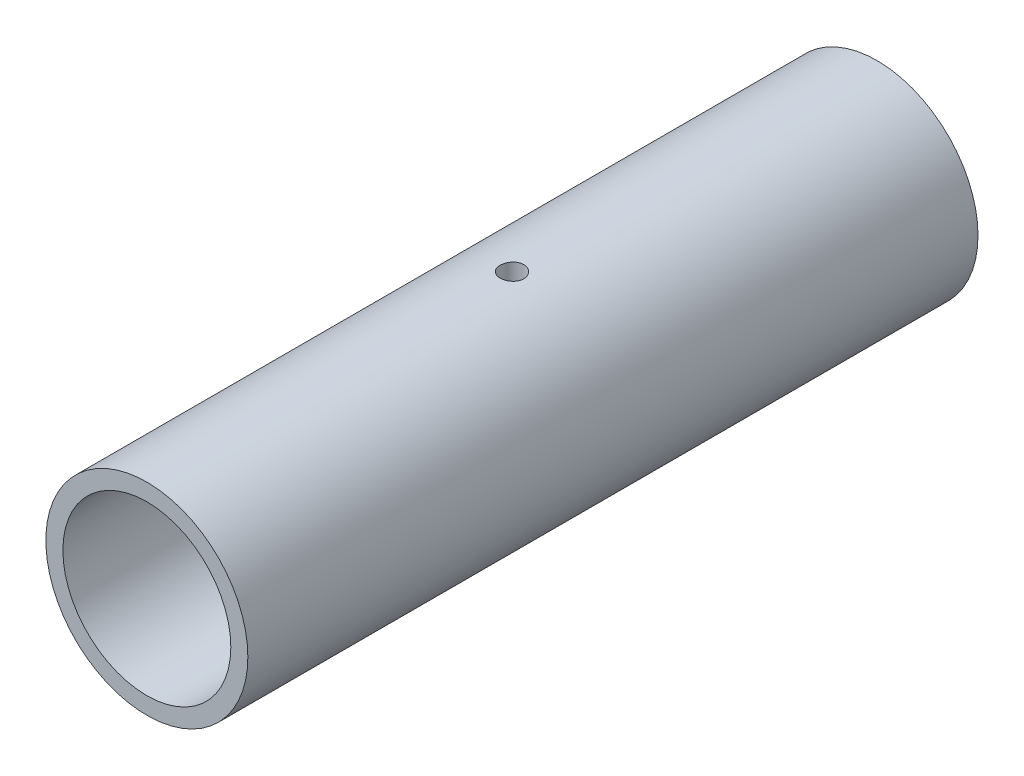
ISO-10303-21;
HEADER;
FILE_DESCRIPTION(('STEP AP214'),'2;1');
FILE_NAME('part.step','',(''),(''),'','','');
FILE_SCHEMA(('AUTOMOTIVE_DESIGN { 1 0 10303 214 1 1 1 1 }'));
ENDSEC;
DATA;
#1=APPLICATION_CONTEXT('core data for automotive mechanical design processes');
#2=APPLICATION_PROTOCOL_DEFINITION('international standard','automotive_design',2000,#1);
#3=PRODUCT_CONTEXT('',#1,'mechanical');
#4=PRODUCT('Part','Part','',(#3));
#5=PRODUCT_RELATED_PRODUCT_CATEGORY('part','',(#4));
#6=PRODUCT_DEFINITION_FORMATION('','',#4);
#7=PRODUCT_DEFINITION_CONTEXT('part definition',#1,'design');
#8=PRODUCT_DEFINITION('design','',#6,#7);
#9=PRODUCT_DEFINITION_SHAPE('','',#8);
#10=(LENGTH_UNIT() NAMED_UNIT(*) SI_UNIT(.MILLI.,.METRE.));
#11=(NAMED_UNIT(*) PLANE_ANGLE_UNIT() SI_UNIT($,.RADIAN.));
#12=(NAMED_UNIT(*) SI_UNIT($,.STERADIAN.) SOLID_ANGLE_UNIT());
#13=UNCERTAINTY_MEASURE_WITH_UNIT(LENGTH_MEASURE(1.E-05),#10,'distance_accuracy_value','');
#14=(GEOMETRIC_REPRESENTATION_CONTEXT(3) GLOBAL_UNCERTAINTY_ASSIGNED_CONTEXT((#13)) GLOBAL_UNIT_ASSIGNED_CONTEXT((#10,
#11,#12)) REPRESENTATION_CONTEXT('',''));
#15=CARTESIAN_POINT('',(0.,0.,0.));
#16=DIRECTION('',(0.,0.,1.));
#17=DIRECTION('',(1.,0.,0.));
#18=AXIS2_PLACEMENT_3D('',#15,#16,#17);
#19=CARTESIAN_POINT('',(-21.0819999999998,21.0819999999998,-152.4));
#20=DIRECTION('',(0.,0.,0.999999999999999));
#21=DIRECTION('',(0.999999999999999,0.,0.));
#22=AXIS2_PLACEMENT_3D('',#19,#20,#21);
#23=CYLINDRICAL_SURFACE('',#22,17.526);
#24=CARTESIAN_POINT('',(-21.0819999999998,21.0819999999998,-152.4));
#25=DIRECTION('',(0.,0.,0.999999999999999));
#26=DIRECTION('',(0.999999999999999,0.,0.));
#27=AXIS2_PLACEMENT_3D('',#24,#25,#26);
#28=CIRCLE('',#27,17.526);
#29=CARTESIAN_POINT('',(-3.55599999999984,21.0819999999998,-152.4));
#30=VERTEX_POINT('',#29);
#31=EDGE_CURVE('E34',#30,#30,#28,.T.);
#32=ORIENTED_EDGE('',*,*,#31,.F.);
#33=EDGE_LOOP('',(#32));
#34=FACE_BOUND('',#33,.T.);
#35=CARTESIAN_POINT('',(-21.082,21.082,0.));
#36=DIRECTION('',(0.,0.,0.999999999999999));
#37=DIRECTION('',(0.999999999999999,0.,0.));
#38=AXIS2_PLACEMENT_3D('',#35,#36,#37);
#39=CIRCLE('',#38,17.526);
#40=CARTESIAN_POINT('',(-3.55600000000007,21.082,0.));
#41=VERTEX_POINT('',#40);
#42=EDGE_CURVE('E47',#41,#41,#39,.T.);
#43=ORIENTED_EDGE('',*,*,#42,.T.);
#44=EDGE_LOOP('',(#43));
#45=FACE_BOUND('',#44,.T.);
#46=CARTESIAN_POINT('',(-21.082,3.55599999999995,-78.65745));
#47=CARTESIAN_POINT('',(-21.219313584699,3.55600209642022,-78.6574442622466));
#48=CARTESIAN_POINT('',(-21.3567093809893,3.55763071351393,-78.6459022714589));
#49=CARTESIAN_POINT('',(-21.627667633178,3.56397088605532,-78.6000469256653));
#50=CARTESIAN_POINT('',(-21.7612261047887,3.56868553297045,-78.5657107358066));
#51=CARTESIAN_POINT('',(-22.0205486108248,3.58066740366486,-78.4753071480244));
#52=CARTESIAN_POINT('',(-22.146318196119,3.58793278441404,-78.4192554376093));
#53=CARTESIAN_POINT('',(-22.3866451043134,3.60421114709342,-78.2870486494609));
#54=CARTESIAN_POINT('',(-22.5012041309102,3.61322386285417,-78.2108966329452));
#55=CARTESIAN_POINT('',(-22.7166653620185,3.63206216037045,-78.0400933465504));
#56=CARTESIAN_POINT('',(-22.8174794946313,3.64189238869374,-77.9453314785533));
#57=CARTESIAN_POINT('',(-23.0018298619565,3.66122096844202,-77.7402362833069));
#58=CARTESIAN_POINT('',(-23.0853651513495,3.67071930168555,-77.6299021046574));
#59=CARTESIAN_POINT('',(-23.2331235961289,3.68835392744121,-77.3962101529735));
#60=CARTESIAN_POINT('',(-23.2972626081304,3.69648421950797,-77.2727986859045));
#61=CARTESIAN_POINT('',(-23.4038702662552,3.71039954073114,-77.0168222523775));
#62=CARTESIAN_POINT('',(-23.4463399438477,3.716184681515,-76.88425772195));
#63=CARTESIAN_POINT('',(-23.5081321629792,3.72470945361032,-76.6146598515697));
#64=CARTESIAN_POINT('',(-23.527604701883,3.72746881184983,-76.4776615261784));
#65=CARTESIAN_POINT('',(-23.5433143500359,3.72968965131678,-76.2023160231005));
#66=CARTESIAN_POINT('',(-23.5395526277443,3.72915129838731,-76.0639689135942));
#67=CARTESIAN_POINT('',(-23.5090233387237,3.72485559083148,-75.7909066955551));
#68=CARTESIAN_POINT('',(-23.4824220706598,3.72112150551341,-75.6561725757621));
#69=CARTESIAN_POINT('',(-23.407228772746,3.7108913913007,-75.3930994293061));
#70=CARTESIAN_POINT('',(-23.3586361930728,3.70439529335092,-75.2647605626253));
#71=CARTESIAN_POINT('',(-23.2406643003693,3.68934710836353,-75.0176106286046));
#72=CARTESIAN_POINT('',(-23.1712137966404,3.68078800009034,-74.8988339876509));
#73=CARTESIAN_POINT('',(-23.0135482916026,3.66258339786613,-74.674557755089));
#74=CARTESIAN_POINT('',(-22.9253322122598,3.65293784151646,-74.5690589268114));
#75=CARTESIAN_POINT('',(-22.7317232165584,3.63354406879054,-74.3733686318438));
#76=CARTESIAN_POINT('',(-22.6261871698088,3.62379569088719,-74.283318728914));
#77=CARTESIAN_POINT('',(-22.4014238936926,3.60537304167416,-74.1221883512029));
#78=CARTESIAN_POINT('',(-22.2821966172447,3.59669877405833,-74.0511079416564));
#79=CARTESIAN_POINT('',(-22.0333181872324,3.58139423424283,-73.9299299563282));
#80=CARTESIAN_POINT('',(-21.9036620654066,3.57476494362076,-73.8798424529004));
#81=CARTESIAN_POINT('',(-21.6376654465838,3.56430574982263,-73.8021907249373));
#82=CARTESIAN_POINT('',(-21.5013253444932,3.56047568147371,-73.7746251714447));
#83=CARTESIAN_POINT('',(-21.2270536681809,3.55606818112011,-73.742986102272));
#84=CARTESIAN_POINT('',(-21.0891449800864,3.555463781399,-73.7387178065238));
#85=CARTESIAN_POINT('',(-20.8145799875361,3.55750255470454,-73.7532786362681));
#86=CARTESIAN_POINT('',(-20.6779236494297,3.56014564021233,-73.772107139308));
#87=CARTESIAN_POINT('',(-20.4103262319333,3.56836569622856,-73.8321651778927));
#88=CARTESIAN_POINT('',(-20.2793636305966,3.57393034406432,-73.8733006500605));
#89=CARTESIAN_POINT('',(-20.026194684721,3.58737120982079,-73.9767063263398));
#90=CARTESIAN_POINT('',(-19.9039887058728,3.59524752421053,-74.0389774124867));
#91=CARTESIAN_POINT('',(-19.6709399354164,3.61250247247454,-74.1833495176409));
#92=CARTESIAN_POINT('',(-19.5601750127325,3.62189041364331,-74.2655751021692));
#93=CARTESIAN_POINT('',(-19.3539476599996,3.64109238959788,-74.447347550135));
#94=CARTESIAN_POINT('',(-19.2584860022372,3.65090644585605,-74.546895287215));
#95=CARTESIAN_POINT('',(-19.084873494318,3.66993912108242,-74.7613496910569));
#96=CARTESIAN_POINT('',(-19.0068526267323,3.67915292852368,-74.8763620766203));
#97=CARTESIAN_POINT('',(-18.8712376307225,3.69585913422194,-75.1179738385939));
#98=CARTESIAN_POINT('',(-18.8136430068646,3.70335157422876,-75.2445729338773));
#99=CARTESIAN_POINT('',(-18.7207205849107,3.7157326732237,-75.505363752403));
#100=CARTESIAN_POINT('',(-18.6853223769144,3.72062955792281,-75.6395299803733));
#101=CARTESIAN_POINT('',(-18.6375723521363,3.72728765905977,-75.9119761976783));
#102=CARTESIAN_POINT('',(-18.625219160628,3.72904906254118,-76.0502559411255));
#103=CARTESIAN_POINT('',(-18.6239394593903,3.72923039684615,-76.3257094488086));
#104=CARTESIAN_POINT('',(-18.6348086578768,3.72767946694316,-76.4628822889183));
#105=CARTESIAN_POINT('',(-18.6792295476167,3.72147393068927,-76.7334295858085));
#106=CARTESIAN_POINT('',(-18.7127812198902,3.71681932693544,-76.8668040457673));
#107=CARTESIAN_POINT('',(-18.8015457855231,3.70494060335147,-77.1259241349824));
#108=CARTESIAN_POINT('',(-18.8567462116219,3.69771796264655,-77.2516741070519));
#109=CARTESIAN_POINT('',(-18.9872212130195,3.68151493200183,-77.4921604771149));
#110=CARTESIAN_POINT('',(-19.0624962934701,3.67253449783099,-77.6068965978607));
#111=CARTESIAN_POINT('',(-19.2317327758756,3.65373341306555,-77.8231390915374));
#112=CARTESIAN_POINT('',(-19.3258459389085,3.64390633406355,-77.9245261453698));
#113=CARTESIAN_POINT('',(-19.5297671042763,3.62457418658418,-78.1101427190558));
#114=CARTESIAN_POINT('',(-19.6395787686698,3.61506919388308,-78.1943682244099));
#115=CARTESIAN_POINT('',(-19.8723927375176,3.5974008099648,-78.3436249326874));
#116=CARTESIAN_POINT('',(-19.9954556347014,3.58924405473427,-78.4085623792496));
#117=CARTESIAN_POINT('',(-20.2507927982238,3.57525690495254,-78.516752085084));
#118=CARTESIAN_POINT('',(-20.3830571605334,3.56942405320852,-78.5600272615678));
#119=CARTESIAN_POINT('',(-20.6102948179795,3.56210435859795,-78.6136216841233));
#120=CARTESIAN_POINT('',(-20.7038521817239,3.5598267289628,-78.6300328107652));
#121=CARTESIAN_POINT('',(-20.8922599526292,3.5567738329563,-78.651948895679));
#122=CARTESIAN_POINT('',(-20.9871103466098,3.55599855128245,-78.6574539650369));
#123=CARTESIAN_POINT('',(-21.082,3.55599999999995,-78.65745));
#124=B_SPLINE_CURVE_WITH_KNOTS('',3,(#46,#47,#48,#49,#50,#51,#52,#53,#54,#55,#56,#57,#58,#59,
#60,#61,#62,#63,#64,#65,#66,#67,#68,#69,#70,#71,#72,#73,#74,#75,#76,#77,#78,#79,#80,#81,#82,#83,
#84,#85,#86,#87,#88,#89,#90,#91,#92,#93,#94,#95,#96,#97,#98,#99,#100,#101,#102,#103,#104,#105,
#106,#107,#108,#109,#110,#111,#112,#113,#114,#115,#116,#117,#118,#119,#120,#121,#122,#123),
.UNSPECIFIED.,.T.,.F.,(4,2,2,2,2,2,2,2,2,2,2,2,2,2,2,2,2,2,2,2,2,2,2,2,2,2,2,2,2,2,2,2,2,2,2,2,
2,2,4),(0.,0.411594074113733,0.823601099863392,1.23531104097033,1.64695831600509,
2.06113037740559,2.47532509201975,2.89129167521455,3.30723845638449,3.72045699906316,
4.13365476100368,4.54386922837036,4.95409395241802,5.36573505181149,5.77739980531222,
6.19265575441998,6.60791313154563,7.02336952086858,7.43880139350359,7.8507546065506,
8.26269671781037,8.67291511996528,9.08315064353467,9.49601608401858,9.90890235340311,
10.3247701537904,10.7406278667108,11.1551596616744,11.569666727386,11.9805423182014,
12.3914175652087,12.8020565406702,13.2127058502912,13.6268071454151,14.0410051978756,
14.4571848396401,14.8729232561056,15.1573555425078,15.4417849317469),.UNSPECIFIED.);
#125=CARTESIAN_POINT('',(-21.082,3.55599999999995,-78.65745));
#126=VERTEX_POINT('',#125);
#127=EDGE_CURVE('E56',#126,#126,#124,.T.);
#128=ORIENTED_EDGE('',*,*,#127,.F.);
#129=EDGE_LOOP('',(#128));
#130=FACE_BOUND('',#129,.T.);
#131=CARTESIAN_POINT('',(-21.082,38.6080000000003,-78.6574499999999));
#132=CARTESIAN_POINT('',(-20.9446864153011,38.6079979035802,-78.6574442622465));
#133=CARTESIAN_POINT('',(-20.8072906190108,38.6063692864857,-78.6459022714589));
#134=CARTESIAN_POINT('',(-20.5363323668221,38.6000291139443,-78.6000469256654));
#135=CARTESIAN_POINT('',(-20.4027738952114,38.5953144670299,-78.5657107358066));
#136=CARTESIAN_POINT('',(-20.1434513891753,38.5833325963355,-78.4753071480244));
#137=CARTESIAN_POINT('',(-20.0176818038811,38.5760672155856,-78.4192554376092));
#138=CARTESIAN_POINT('',(-19.7773548956866,38.5597888529062,-78.2870486494609));
#139=CARTESIAN_POINT('',(-19.6627958690897,38.5507761371462,-78.2108966329452));
#140=CARTESIAN_POINT('',(-19.4473346379814,38.5319378396299,-78.0400933465504));
#141=CARTESIAN_POINT('',(-19.3465205053687,38.5221076113059,-77.9453314785532));
#142=CARTESIAN_POINT('',(-19.1621701380435,38.5027790315576,-77.7402362833068));
#143=CARTESIAN_POINT('',(-19.0786348486503,38.4932806983148,-77.6299021046574));
#144=CARTESIAN_POINT('',(-18.930876403871,38.4756460725591,-77.3962101529735));
#145=CARTESIAN_POINT('',(-18.8667373918697,38.4675157804917,-77.2727986859045));
#146=CARTESIAN_POINT('',(-18.7601297337449,38.4536004592686,-77.0168222523775));
#147=CARTESIAN_POINT('',(-18.7176600561521,38.4478153184854,-76.8842577219501));
#148=CARTESIAN_POINT('',(-18.6558678370207,38.43929054639,-76.6146598515699));
#149=CARTESIAN_POINT('',(-18.6363952981171,38.4365311881499,-76.4776615261785));
#150=CARTESIAN_POINT('',(-18.6206856499643,38.4343103486829,-76.2023160231006));
#151=CARTESIAN_POINT('',(-18.6244473722558,38.434848701613,-76.0639689135943));
#152=CARTESIAN_POINT('',(-18.6549766612764,38.4391444091689,-75.7909066955552));
#153=CARTESIAN_POINT('',(-18.6815779293403,38.4428784944864,-75.6561725757622));
#154=CARTESIAN_POINT('',(-18.7567712272541,38.4531086086989,-75.3930994293062));
#155=CARTESIAN_POINT('',(-18.8053638069271,38.4596047066491,-75.2647605626253));
#156=CARTESIAN_POINT('',(-18.9233356996306,38.4746528916365,-75.0176106286046));
#157=CARTESIAN_POINT('',(-18.9927862033597,38.4832119999093,-74.898833987651));
#158=CARTESIAN_POINT('',(-19.1504517083975,38.5014166021335,-74.6745577550891));
#159=CARTESIAN_POINT('',(-19.2386677877401,38.5110621584836,-74.5690589268114));
#160=CARTESIAN_POINT('',(-19.4322767834415,38.5304559312095,-74.3733686318438));
#161=CARTESIAN_POINT('',(-19.5378128301912,38.5402043091125,-74.2833187289141));
#162=CARTESIAN_POINT('',(-19.7625761063074,38.5586269583255,-74.122188351203));
#163=CARTESIAN_POINT('',(-19.8818033827552,38.5673012259417,-74.0511079416564));
#164=CARTESIAN_POINT('',(-20.1306818127674,38.5826057657572,-73.9299299563282));
#165=CARTESIAN_POINT('',(-20.2603379345933,38.5892350563789,-73.8798424529005));
#166=CARTESIAN_POINT('',(-20.5263345534161,38.599694250177,-73.8021907249373));
#167=CARTESIAN_POINT('',(-20.6626746555067,38.6035243185263,-73.7746251714447));
#168=CARTESIAN_POINT('',(-20.936946331819,38.6079318188799,-73.7429861022719));
#169=CARTESIAN_POINT('',(-21.0748550199134,38.6085362186006,-73.7387178065237));
#170=CARTESIAN_POINT('',(-21.3494200124638,38.6064974452951,-73.7532786362682));
#171=CARTESIAN_POINT('',(-21.4860763505702,38.6038543597877,-73.7721071393081));
#172=CARTESIAN_POINT('',(-21.7536737680666,38.5956343037714,-73.8321651778927));
#173=CARTESIAN_POINT('',(-21.8846363694033,38.5900696559353,-73.8733006500604));
#174=CARTESIAN_POINT('',(-22.137805315279,38.5766287901788,-73.9767063263398));
#175=CARTESIAN_POINT('',(-22.2600112941272,38.5687524757895,-74.0389774124866));
#176=CARTESIAN_POINT('',(-22.4930600645837,38.5514975275255,-74.1833495176409));
#177=CARTESIAN_POINT('',(-22.6038249872676,38.5421095863563,-74.2655751021692));
#178=CARTESIAN_POINT('',(-22.8100523400005,38.5229076104017,-74.447347550135));
#179=CARTESIAN_POINT('',(-22.9055139977628,38.513093554144,-74.546895287215));
#180=CARTESIAN_POINT('',(-23.0791265056821,38.4940608789176,-74.7613496910569));
#181=CARTESIAN_POINT('',(-23.1571473732678,38.4848470714758,-74.8763620766203));
#182=CARTESIAN_POINT('',(-23.2927623692775,38.4681408657777,-75.1179738385938));
#183=CARTESIAN_POINT('',(-23.3503569931353,38.4606484257714,-75.2445729338773));
#184=CARTESIAN_POINT('',(-23.4432794150892,38.4482673267764,-75.505363752403));
#185=CARTESIAN_POINT('',(-23.4786776230857,38.4433704420767,-75.6395299803733));
#186=CARTESIAN_POINT('',(-23.5264276478638,38.4367123409398,-75.9119761976782));
#187=CARTESIAN_POINT('',(-23.5387808393719,38.4349509374591,-76.0502559411254));
#188=CARTESIAN_POINT('',(-23.5400605406096,38.4347696031541,-76.3257094488086));
#189=CARTESIAN_POINT('',(-23.5291913421233,38.4363205330564,-76.4628822889183));
#190=CARTESIAN_POINT('',(-23.4847704523834,38.4425260693103,-76.7334295858086));
#191=CARTESIAN_POINT('',(-23.4512187801097,38.4471806730649,-76.8668040457673));
#192=CARTESIAN_POINT('',(-23.3624542144768,38.4590593966489,-77.1259241349824));
#193=CARTESIAN_POINT('',(-23.307253788378,38.466282037353,-77.251674107052));
#194=CARTESIAN_POINT('',(-23.1767787869806,38.4824850679978,-77.492160477115));
#195=CARTESIAN_POINT('',(-23.10150370653,38.4914655021694,-77.6068965978607));
#196=CARTESIAN_POINT('',(-22.9322672241245,38.5102665869348,-77.8231390915374));
#197=CARTESIAN_POINT('',(-22.8381540610916,38.520093665936,-77.9245261453699));
#198=CARTESIAN_POINT('',(-22.6342328957236,38.5394258134154,-78.1101427190559));
#199=CARTESIAN_POINT('',(-22.5244212313301,38.5489308061172,-78.1943682244098));
#200=CARTESIAN_POINT('',(-22.2916072624822,38.5665991900355,-78.3436249326874));
#201=CARTESIAN_POINT('',(-22.1685443652984,38.5747559452653,-78.4085623792497));
#202=CARTESIAN_POINT('',(-21.913207201776,38.5887430950471,-78.5167520850841));
#203=CARTESIAN_POINT('',(-21.7809428394664,38.594575946792,-78.5600272615678));
#204=CARTESIAN_POINT('',(-21.5537051820204,38.6018956414023,-78.6136216841233));
#205=CARTESIAN_POINT('',(-21.460147818276,38.6041732710368,-78.6300328107653));
#206=CARTESIAN_POINT('',(-21.2717400473708,38.6072261670433,-78.651948895679));
#207=CARTESIAN_POINT('',(-21.1768896533903,38.6080014487177,-78.6574539650368));
#208=CARTESIAN_POINT('',(-21.082,38.6080000000003,-78.6574499999999));
#209=B_SPLINE_CURVE_WITH_KNOTS('',3,(#131,#132,#133,#134,#135,#136,#137,#138,#139,#140,#141,
#142,#143,#144,#145,#146,#147,#148,#149,#150,#151,#152,#153,#154,#155,#156,#157,#158,#159,#160,
#161,#162,#163,#164,#165,#166,#167,#168,#169,#170,#171,#172,#173,#174,#175,#176,#177,#178,#179,
#180,#181,#182,#183,#184,#185,#186,#187,#188,#189,#190,#191,#192,#193,#194,#195,#196,#197,#198,
#199,#200,#201,#202,#203,#204,#205,#206,#207,#208),.UNSPECIFIED.,.T.,.F.,(4,2,2,2,2,2,2,2,2,2,2,
2,2,2,2,2,2,2,2,2,2,2,2,2,2,2,2,2,2,2,2,2,2,2,2,2,2,2,4),(0.,0.411594074113725,
0.823601099863367,1.23531104097039,1.64695831600524,2.06113037740572,2.47532509201988,
2.89129167521462,3.30723845638447,3.72045699906311,4.13365476100364,4.54386922837037,
4.95409395241802,5.36573505181149,5.7773998053122,6.19265575441994,6.60791313154559,
7.02336952086855,7.43880139350355,7.85075460655054,8.26269671781033,8.67291511996534,
9.08315064353482,9.49601608401872,9.90890235340325,10.3247701537905,10.7406278667108,
11.1551596616745,11.5696667273861,11.9805423182015,12.3914175652088,12.8020565406704,
13.2127058502913,13.6268071454152,14.0410051978758,14.4571848396403,14.8729232561058,
15.1573555425079,15.4417849317469),.UNSPECIFIED.);
#210=CARTESIAN_POINT('',(-21.082,38.6080000000003,-78.6574499999999));
#211=VERTEX_POINT('',#210);
#212=EDGE_CURVE('E50',#211,#211,#209,.T.);
#213=ORIENTED_EDGE('',*,*,#212,.F.);
#214=EDGE_LOOP('',(#213));
#215=FACE_BOUND('',#214,.T.);
#216=ADVANCED_FACE('F14',(#34,#45,#130,#215),#23,.F.);
#217=CARTESIAN_POINT('',(-21.0819999999998,21.0819999999998,-152.4));
#218=DIRECTION('',(0.,0.,0.999999999999999));
#219=DIRECTION('',(0.999999999999999,0.,0.));
#220=AXIS2_PLACEMENT_3D('',#217,#218,#219);
#221=CYLINDRICAL_SURFACE('',#220,21.082);
#222=CARTESIAN_POINT('',(-21.082,21.082,0.));
#223=DIRECTION('',(0.,0.,0.999999999999999));
#224=DIRECTION('',(0.999999999999999,0.,0.));
#225=AXIS2_PLACEMENT_3D('',#222,#223,#224);
#226=CIRCLE('',#225,21.082);
#227=CARTESIAN_POINT('',(0.,21.082,0.));
#228=VERTEX_POINT('',#227);
#229=EDGE_CURVE('E43',#228,#228,#226,.T.);
#230=ORIENTED_EDGE('',*,*,#229,.F.);
#231=EDGE_LOOP('',(#230));
#232=FACE_BOUND('',#231,.T.);
#233=CARTESIAN_POINT('',(-21.0819999999998,21.0819999999998,-152.4));
#234=DIRECTION('',(0.,0.,0.999999999999999));
#235=DIRECTION('',(0.999999999999999,0.,0.));
#236=AXIS2_PLACEMENT_3D('',#233,#234,#235);
#237=CIRCLE('',#236,21.082);
#238=CARTESIAN_POINT('',(1.52655665885959E-13,21.0819999999998,-152.4));
#239=VERTEX_POINT('',#238);
#240=EDGE_CURVE('E25',#239,#239,#237,.T.);
#241=ORIENTED_EDGE('',*,*,#240,.T.);
#242=EDGE_LOOP('',(#241));
#243=FACE_BOUND('',#242,.T.);
#244=CARTESIAN_POINT('',(-21.082,42.1640000000003,-78.6574499999999));
#245=CARTESIAN_POINT('',(-20.9444644128489,42.1639981896703,-78.6574441133679));
#246=CARTESIAN_POINT('',(-20.8068410729085,42.1626398639896,-78.6458649518291));
#247=CARTESIAN_POINT('',(-20.5354188670991,42.1573518736463,-78.5998532969384));
#248=CARTESIAN_POINT('',(-20.4016242328091,42.1534194705401,-78.5653964645158));
#249=CARTESIAN_POINT('',(-20.1418285200257,42.1434266548059,-78.4746540359121));
#250=CARTESIAN_POINT('',(-20.0158224509763,42.1373676218032,-78.4183825892291));
#251=CARTESIAN_POINT('',(-19.7750680496314,42.1237967399054,-78.2856380093583));
#252=CARTESIAN_POINT('',(-19.6603176806375,42.1162851545807,-78.209168540248));
#253=CARTESIAN_POINT('',(-19.4447540663791,42.1006083763951,-78.0378043334997));
#254=CARTESIAN_POINT('',(-19.3440028000324,42.0924405147707,-77.9428318673855));
#255=CARTESIAN_POINT('',(-19.1598307768086,42.076393466281,-77.7373241906216));
#256=CARTESIAN_POINT('',(-19.0764108725656,42.0685142936337,-77.6267882147575));
#257=CARTESIAN_POINT('',(-18.9290423957565,42.0539101911831,-77.3928933010846));
#258=CARTESIAN_POINT('',(-18.8651512364394,42.0471886896702,-77.2694979568614));
#259=CARTESIAN_POINT('',(-18.7590205029762,42.0356955439044,-77.0136380909333));
#260=CARTESIAN_POINT('',(-18.7167802121994,42.0309238351158,-76.8811738695672));
#261=CARTESIAN_POINT('',(-18.6553371095601,42.0238956403553,-76.6115762423735));
#262=CARTESIAN_POINT('',(-18.6360302213175,42.0216277946848,-76.4744668574789));
#263=CARTESIAN_POINT('',(-18.6206800442439,42.0198291899757,-76.1989366398657));
#264=CARTESIAN_POINT('',(-18.6246359375943,42.0202983347163,-76.0605158534211));
#265=CARTESIAN_POINT('',(-18.655613474821,42.0239103117648,-75.7870145438806));
#266=CARTESIAN_POINT('',(-18.6825208418816,42.0270398973114,-75.6519208777595));
#267=CARTESIAN_POINT('',(-18.7584594014298,42.0355994649233,-75.3881797186206));
#268=CARTESIAN_POINT('',(-18.8074909885016,42.0410294880166,-75.2595323406174));
#269=CARTESIAN_POINT('',(-18.9264101851965,42.0535932157184,-75.011978403679));
#270=CARTESIAN_POINT('',(-18.9963478303252,42.0607309993205,-74.8930960960935));
#271=CARTESIAN_POINT('',(-19.1550580213817,42.0759027542919,-74.6687125412231));
#272=CARTESIAN_POINT('',(-19.2438313168173,42.0839367613176,-74.5632118266853));
#273=CARTESIAN_POINT('',(-19.4383279744758,42.1000546873897,-74.3679226587122));
#274=CARTESIAN_POINT('',(-19.544149907484,42.10813861649,-74.2782323476546));
#275=CARTESIAN_POINT('',(-19.7693995142763,42.123400264565,-74.1178728596449));
#276=CARTESIAN_POINT('',(-19.8888272128769,42.1305779818868,-74.0472037173877));
#277=CARTESIAN_POINT('',(-20.1379711415483,42.1432221258942,-73.9268939862445));
#278=CARTESIAN_POINT('',(-20.2676901603032,42.1486880867389,-73.8772591203739));
#279=CARTESIAN_POINT('',(-20.5336991303931,42.1572884694048,-73.8005026322442));
#280=CARTESIAN_POINT('',(-20.6699888141772,42.1604229860746,-73.7733800941238));
#281=CARTESIAN_POINT('',(-20.9444212882666,42.1639950339558,-73.7425443948493));
#282=CARTESIAN_POINT('',(-21.0825486836278,42.1644481503476,-73.7386959541073));
#283=CARTESIAN_POINT('',(-21.3574804787674,42.1626483192137,-73.7541613017361));
#284=CARTESIAN_POINT('',(-21.4942849029258,42.1603954216509,-73.7734746624555));
#285=CARTESIAN_POINT('',(-21.7622913654381,42.1534464899951,-73.8346030454453));
#286=CARTESIAN_POINT('',(-21.8935082160526,42.148757415072,-73.8763539842865));
#287=CARTESIAN_POINT('',(-22.1470770901542,42.1374614675239,-73.9811060215454));
#288=CARTESIAN_POINT('',(-22.2694288487069,42.1308545376131,-74.0441077547283));
#289=CARTESIAN_POINT('',(-22.502401305639,42.116421455777,-74.1899032535193));
#290=CARTESIAN_POINT('',(-22.6129665917272,42.1085899380498,-74.2727850245395));
#291=CARTESIAN_POINT('',(-22.8186648265723,42.0926017013239,-74.4558627825721));
#292=CARTESIAN_POINT('',(-22.9137972449386,42.0844449711605,-74.5560593644088));
#293=CARTESIAN_POINT('',(-23.0864055591656,42.0686779589736,-74.7715164290804));
#294=CARTESIAN_POINT('',(-23.1637920977477,42.0610705691354,-74.8868487404975));
#295=CARTESIAN_POINT('',(-23.2980957214879,42.0473099402236,-75.1289527981102));
#296=CARTESIAN_POINT('',(-23.355013171095,42.0411566752603,-75.2557243405818));
#297=CARTESIAN_POINT('',(-23.4466164798638,42.0310201779777,-75.5168134210649));
#298=CARTESIAN_POINT('',(-23.4813537244218,42.0270319331441,-75.6511127276454));
#299=CARTESIAN_POINT('',(-23.5277765159362,42.0216622759768,-75.9236873183407));
#300=CARTESIAN_POINT('',(-23.5394629849245,42.020280759374,-76.0619624431983));
#301=CARTESIAN_POINT('',(-23.5394370708632,42.0202837303198,-76.3376749161658));
#302=CARTESIAN_POINT('',(-23.5278650584213,42.0216516245053,-76.4751122989259));
#303=CARTESIAN_POINT('',(-23.4819468591478,42.0269637239781,-76.7460751763494));
#304=CARTESIAN_POINT('',(-23.4476006605476,42.0309079305967,-76.8796006689915));
#305=CARTESIAN_POINT('',(-23.3571511294317,42.0409233045324,-77.1389372003668));
#306=CARTESIAN_POINT('',(-23.3010536229897,42.0469939022551,-77.2647502944196));
#307=CARTESIAN_POINT('',(-23.1687078146467,42.0605790794332,-77.5051991675268));
#308=CARTESIAN_POINT('',(-23.0924593911784,42.0680936675999,-77.6198348791443));
#309=CARTESIAN_POINT('',(-22.921452677608,42.0837744977372,-77.835393379043));
#310=CARTESIAN_POINT('',(-22.8265896915736,42.0919442634249,-77.9362328582048));
#311=CARTESIAN_POINT('',(-22.6212624117664,42.1079833622732,-78.1206178870807));
#312=CARTESIAN_POINT('',(-22.5107944252909,42.1158526237623,-78.2041593318885));
#313=CARTESIAN_POINT('',(-22.2769769513209,42.1304324834559,-78.3518081882211));
#314=CARTESIAN_POINT('',(-22.153585838109,42.1371391405083,-78.4158500316198));
#315=CARTESIAN_POINT('',(-21.8977950896914,42.1485974023543,-78.5222151190348));
#316=CARTESIAN_POINT('',(-21.7654055601761,42.1533511594191,-78.5645622853249));
#317=CARTESIAN_POINT('',(-21.5405890879154,42.1592043875156,-78.6160454079474));
#318=CARTESIAN_POINT('',(-21.4495873323943,42.1609941178969,-78.6315502180808));
#319=CARTESIAN_POINT('',(-21.2664035312263,42.1633925274692,-78.6522544561953));
#320=CARTESIAN_POINT('',(-21.1742214927955,42.1640012138777,-78.6574539471528));
#321=CARTESIAN_POINT('',(-21.082,42.1640000000003,-78.6574499999999));
#322=B_SPLINE_CURVE_WITH_KNOTS('',3,(#244,#245,#246,#247,#248,#249,#250,#251,#252,#253,#254,
#255,#256,#257,#258,#259,#260,#261,#262,#263,#264,#265,#266,#267,#268,#269,#270,#271,#272,#273,
#274,#275,#276,#277,#278,#279,#280,#281,#282,#283,#284,#285,#286,#287,#288,#289,#290,#291,#292,
#293,#294,#295,#296,#297,#298,#299,#300,#301,#302,#303,#304,#305,#306,#307,#308,#309,#310,#311,
#312,#313,#314,#315,#316,#317,#318,#319,#320,#321),.UNSPECIFIED.,.T.,.F.,(4,2,2,2,2,2,2,2,2,2,2,
2,2,2,2,2,2,2,2,2,2,2,2,2,2,2,2,2,2,2,2,2,2,2,2,2,2,2,4),(0.,0.412269941606798,
0.824979192800648,1.23742119725815,1.64978843287182,2.06392684568482,2.47808562764066,
2.89345055103039,3.30880172520558,3.72226066186233,4.1357050631837,4.54710283560507,
4.95850794557343,5.37090568455279,5.78331983673378,6.19821019320771,6.61310130643732,
7.02810523106399,7.44309227140166,7.85566488287464,8.26822987686847,8.6796227677794,
9.09102794815913,9.50428909680521,9.91756444523802,10.3328772064413,10.7481825727001,
11.162522266582,11.5768453865226,11.9886754741002,12.4005057744904,12.8122258425142,
13.2239483944366,13.6380566877445,14.0522631385877,14.4678473721359,14.8829723577925,
15.1594126783116,15.4358513094848),.UNSPECIFIED.);
#323=CARTESIAN_POINT('',(-21.082,42.1640000000003,-78.6574499999999));
#324=VERTEX_POINT('',#323);
#325=EDGE_CURVE('E52',#324,#324,#322,.T.);
#326=ORIENTED_EDGE('',*,*,#325,.T.);
#327=EDGE_LOOP('',(#326));
#328=FACE_BOUND('',#327,.T.);
#329=CARTESIAN_POINT('',(-21.082,0.,-78.6574499999999));
#330=CARTESIAN_POINT('',(-21.2195355871512,1.810330175566E-06,-78.6574441133679));
#331=CARTESIAN_POINT('',(-21.3571589270916,0.00136013601006596,-78.6458649518292));
#332=CARTESIAN_POINT('',(-21.6285811329008,0.00664812635326151,-78.5998532969384));
#333=CARTESIAN_POINT('',(-21.7623757671908,0.0105805294602173,-78.5653964645157));
#334=CARTESIAN_POINT('',(-22.0221714799742,0.0205733451944307,-78.474654035912));
#335=CARTESIAN_POINT('',(-22.1481775490237,0.02663237819641,-78.4183825892292));
#336=CARTESIAN_POINT('',(-22.3889319503686,0.0402032600942374,-78.2856380093584));
#337=CARTESIAN_POINT('',(-22.5036823193624,0.0477148454197174,-78.2091685402479));
#338=CARTESIAN_POINT('',(-22.7192459336208,0.0633916236053231,-78.0378043334995));
#339=CARTESIAN_POINT('',(-22.8199971999677,0.0715594852290092,-77.9428318673855));
#340=CARTESIAN_POINT('',(-23.0041692231914,0.0876065337186863,-77.7373241906216));
#341=CARTESIAN_POINT('',(-23.0875891274342,0.0954857063666281,-77.6267882147574));
#342=CARTESIAN_POINT('',(-23.2349576042434,0.110089808817224,-77.3928933010845));
#343=CARTESIAN_POINT('',(-23.2988487635607,0.116811310329518,-77.2694979568614));
#344=CARTESIAN_POINT('',(-23.4049794970239,0.12830445609527,-77.0136380909333));
#345=CARTESIAN_POINT('',(-23.4472197878004,0.133076164884623,-76.8811738695671));
#346=CARTESIAN_POINT('',(-23.5086628904397,0.14010435964512,-76.6115762423733));
#347=CARTESIAN_POINT('',(-23.5279697786826,0.14237220531485,-76.4744668574788));
#348=CARTESIAN_POINT('',(-23.5433199557562,0.144170810023909,-76.1989366398656));
#349=CARTESIAN_POINT('',(-23.5393640624056,0.143701665283949,-76.060515853421));
#350=CARTESIAN_POINT('',(-23.5083865251789,0.140089688235575,-75.7870145438805));
#351=CARTESIAN_POINT('',(-23.4814791581184,0.136960102688349,-75.6519208777594));
#352=CARTESIAN_POINT('',(-23.4055405985702,0.128400535076317,-75.3881797186204));
#353=CARTESIAN_POINT('',(-23.3565090114983,0.122970511983439,-75.2595323406173));
#354=CARTESIAN_POINT('',(-23.2375898148034,0.110406784281655,-75.0119784036789));
#355=CARTESIAN_POINT('',(-23.1676521696747,0.1032690006791,-74.8930960960933));
#356=CARTESIAN_POINT('',(-23.0089419786182,0.0880972457077293,-74.6687125412229));
#357=CARTESIAN_POINT('',(-22.9201686831826,0.0800632386824426,-74.5632118266852));
#358=CARTESIAN_POINT('',(-22.725672025524,0.0639453126103484,-74.3679226587121));
#359=CARTESIAN_POINT('',(-22.619850092516,0.0558613835096492,-74.2782323476545));
#360=CARTESIAN_POINT('',(-22.3946004857237,0.0405997354346204,-74.1178728596449));
#361=CARTESIAN_POINT('',(-22.2751727871232,0.0334220181132356,-74.0472037173875));
#362=CARTESIAN_POINT('',(-22.0260288584518,0.0207778741058077,-73.9268939862443));
#363=CARTESIAN_POINT('',(-21.8963098396968,0.0153119132606842,-73.8772591203738));
#364=CARTESIAN_POINT('',(-21.6303008696068,0.00671153059486654,-73.8005026322441));
#365=CARTESIAN_POINT('',(-21.4940111858227,0.00357701392537317,-73.7733800941237));
#366=CARTESIAN_POINT('',(-21.2195787117333,4.96604417280258E-06,-73.7425443948492));
#367=CARTESIAN_POINT('',(-21.0814513163722,-0.000448150347954495,-73.7386959541073));
#368=CARTESIAN_POINT('',(-20.8065195212326,0.00135168078596099,-73.7541613017361));
#369=CARTESIAN_POINT('',(-20.6697150970743,0.00360457834910945,-73.7734746624555));
#370=CARTESIAN_POINT('',(-20.401708634562,0.0105535100049108,-73.8346030454453));
#371=CARTESIAN_POINT('',(-20.2704917839475,0.0152425849275855,-73.8763539842865));
#372=CARTESIAN_POINT('',(-20.0169229098457,0.0265385324756857,-73.9811060215455));
#373=CARTESIAN_POINT('',(-19.894571151293,0.0331454623869666,-74.0441077547284));
#374=CARTESIAN_POINT('',(-19.6615986943609,0.0475785442229833,-74.1899032535194));
#375=CARTESIAN_POINT('',(-19.5510334082727,0.0554100619498288,-74.2727850245397));
#376=CARTESIAN_POINT('',(-19.3453351734276,0.0713982986757219,-74.4558627825722));
#377=CARTESIAN_POINT('',(-19.2502027550612,0.0795550288395444,-74.5560593644088));
#378=CARTESIAN_POINT('',(-19.0775944408343,0.0953220410263554,-74.7715164290804));
#379=CARTESIAN_POINT('',(-19.0002079022524,0.102929430864129,-74.8868487404976));
#380=CARTESIAN_POINT('',(-18.8659042785121,0.116690059775987,-75.1289527981103));
#381=CARTESIAN_POINT('',(-18.8089868289049,0.122843324739868,-75.2557243405818));
#382=CARTESIAN_POINT('',(-18.7173835201361,0.132979822022447,-75.5168134210649));
#383=CARTESIAN_POINT('',(-18.6826462755783,0.136968066855462,-75.6511127276454));
#384=CARTESIAN_POINT('',(-18.6362234840639,0.142337724022816,-75.9236873183408));
#385=CARTESIAN_POINT('',(-18.6245370150754,0.143719240626298,-76.0619624431984));
#386=CARTESIAN_POINT('',(-18.6245629291366,0.143716269680527,-76.3376749161658));
#387=CARTESIAN_POINT('',(-18.6361349415788,0.142348375494224,-76.4751122989258));
#388=CARTESIAN_POINT('',(-18.6820531408523,0.137036276021431,-76.7460751763494));
#389=CARTESIAN_POINT('',(-18.7163993394523,0.133092069403636,-76.8796006689915));
#390=CARTESIAN_POINT('',(-18.8068488705682,0.123076695467876,-77.1389372003668));
#391=CARTESIAN_POINT('',(-18.8629463770103,0.11700609774444,-77.2647502944194));
#392=CARTESIAN_POINT('',(-18.9952921853533,0.103420920566358,-77.5051991675267));
#393=CARTESIAN_POINT('',(-19.0715406088215,0.095906332400421,-77.6198348791443));
#394=CARTESIAN_POINT('',(-19.2425473223919,0.0802255022631431,-77.835393379043));
#395=CARTESIAN_POINT('',(-19.3374103084263,0.0720557365747201,-77.9362328582046));
#396=CARTESIAN_POINT('',(-19.5427375882336,0.0560166377264021,-78.1206178870806));
#397=CARTESIAN_POINT('',(-19.653205574709,0.0481473762380959,-78.2041593318886));
#398=CARTESIAN_POINT('',(-19.8870230486789,0.0335675165444599,-78.3518081882212));
#399=CARTESIAN_POINT('',(-20.0104141618909,0.0268608594912241,-78.4158500316197));
#400=CARTESIAN_POINT('',(-20.2662049103087,0.0154025976453418,-78.5222151190347));
#401=CARTESIAN_POINT('',(-20.398594439824,0.010648840581425,-78.5645622853248));
#402=CARTESIAN_POINT('',(-20.6234109120847,0.00479561248461294,-78.6160454079474));
#403=CARTESIAN_POINT('',(-20.7144126676057,0.00300588210271605,-78.6315502180808));
#404=CARTESIAN_POINT('',(-20.8975964687738,0.00060747253038143,-78.6522544561953));
#405=CARTESIAN_POINT('',(-20.9897785072046,-1.21387747492502E-06,-78.6574539471527));
#406=CARTESIAN_POINT('',(-21.082,0.,-78.6574499999999));
#407=B_SPLINE_CURVE_WITH_KNOTS('',3,(#329,#330,#331,#332,#333,#334,#335,#336,#337,#338,#339,
#340,#341,#342,#343,#344,#345,#346,#347,#348,#349,#350,#351,#352,#353,#354,#355,#356,#357,#358,
#359,#360,#361,#362,#363,#364,#365,#366,#367,#368,#369,#370,#371,#372,#373,#374,#375,#376,#377,
#378,#379,#380,#381,#382,#383,#384,#385,#386,#387,#388,#389,#390,#391,#392,#393,#394,#395,#396,
#397,#398,#399,#400,#401,#402,#403,#404,#405,#406),.UNSPECIFIED.,.T.,.F.,(4,2,2,2,2,2,2,2,2,2,2,
2,2,2,2,2,2,2,2,2,2,2,2,2,2,2,2,2,2,2,2,2,2,2,2,2,2,2,4),(0.,0.412269941606704,
0.824979192800478,1.237421197258,1.64978843287169,2.06392684568473,2.47808562764058,
2.89345055103032,3.30880172520553,3.72226066186231,4.13570506318368,4.54710283560505,
4.95850794557344,5.3709056845528,5.7833198367338,6.19821019320763,6.61310130643716,
7.02810523106393,7.4430922714017,7.85566488287458,8.26822987686829,8.67962276777934,
9.09102794815921,9.50428909680525,9.91756444523801,10.3328772064413,10.7481825727001,
11.1625222665819,11.5768453865225,11.9886754741001,12.4005057744903,12.8122258425141,
13.2239483944364,13.6380566877443,14.0522631385875,14.4678473721359,14.8829723577925,
15.1594126783116,15.4358513094849),.UNSPECIFIED.);
#408=CARTESIAN_POINT('',(-21.082,0.,-78.6574499999999));
#409=VERTEX_POINT('',#408);
#410=EDGE_CURVE('E10',#409,#409,#407,.T.);
#411=ORIENTED_EDGE('',*,*,#410,.T.);
#412=EDGE_LOOP('',(#411));
#413=FACE_BOUND('',#412,.T.);
#414=ADVANCED_FACE('F57',(#232,#243,#328,#413),#221,.T.);
#415=CARTESIAN_POINT('',(-21.0819999999998,21.0819999999998,-152.4));
#416=DIRECTION('',(0.,0.,0.999999999999999));
#417=DIRECTION('',(0.999999999999999,0.,0.));
#418=AXIS2_PLACEMENT_3D('',#415,#416,#417);
#419=PLANE('',#418);
#420=ORIENTED_EDGE('',*,*,#31,.T.);
#421=EDGE_LOOP('',(#420));
#422=FACE_BOUND('',#421,.T.);
#423=ORIENTED_EDGE('',*,*,#240,.F.);
#424=EDGE_LOOP('',(#423));
#425=FACE_BOUND('',#424,.T.);
#426=ADVANCED_FACE('F67',(#422,#425),#419,.F.);
#427=CARTESIAN_POINT('',(-21.082,21.082,0.));
#428=DIRECTION('',(0.,0.,0.999999999999999));
#429=DIRECTION('',(0.999999999999999,0.,0.));
#430=AXIS2_PLACEMENT_3D('',#427,#428,#429);
#431=PLANE('',#430);
#432=ORIENTED_EDGE('',*,*,#42,.F.);
#433=EDGE_LOOP('',(#432));
#434=FACE_BOUND('',#433,.T.);
#435=ORIENTED_EDGE('',*,*,#229,.T.);
#436=EDGE_LOOP('',(#435));
#437=FACE_BOUND('',#436,.T.);
#438=ADVANCED_FACE('F65',(#434,#437),#431,.T.);
#439=CARTESIAN_POINT('',(-21.082,311.31621471874,-76.2));
#440=DIRECTION('',(0.,-1.,0.));
#441=DIRECTION('',(0.,0.,-0.999999999999999));
#442=AXIS2_PLACEMENT_3D('',#439,#440,#441);
#443=CYLINDRICAL_SURFACE('',#442,2.45745);
#444=ORIENTED_EDGE('',*,*,#325,.F.);
#445=EDGE_LOOP('',(#444));
#446=FACE_BOUND('',#445,.T.);
#447=ORIENTED_EDGE('',*,*,#212,.T.);
#448=EDGE_LOOP('',(#447));
#449=FACE_BOUND('',#448,.T.);
#450=ADVANCED_FACE('F60',(#446,#449),#443,.F.);
#451=ORIENTED_EDGE('',*,*,#410,.F.);
#452=EDGE_LOOP('',(#451));
#453=FACE_BOUND('',#452,.T.);
#454=ORIENTED_EDGE('',*,*,#127,.T.);
#455=EDGE_LOOP('',(#454));
#456=FACE_BOUND('',#455,.T.);
#457=ADVANCED_FACE('F64',(#453,#456),#443,.F.);
#458=CLOSED_SHELL('',(#216,#414,#426,#438,#450,#457));
#459=MANIFOLD_SOLID_BREP('B1',#458);
#460=ADVANCED_BREP_SHAPE_REPRESENTATION('',(#18,#459),#14);
#461=SHAPE_DEFINITION_REPRESENTATION(#9,#460);
ENDSEC;
END-ISO-10303-21;
